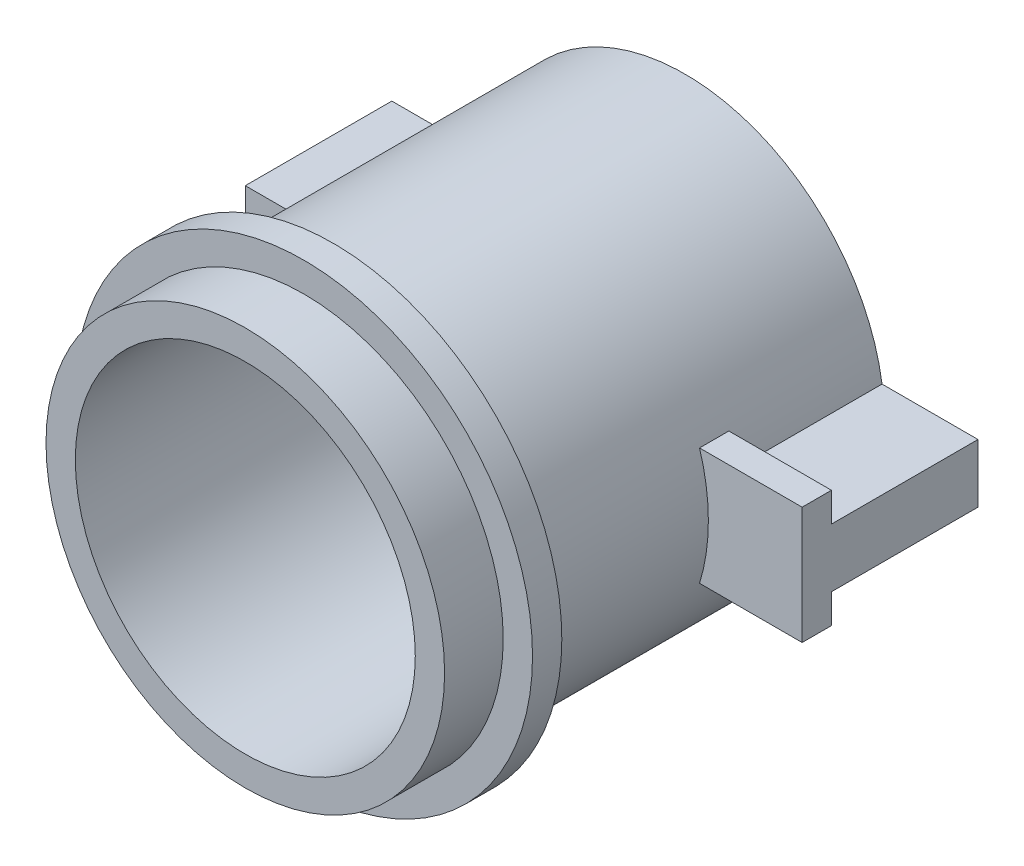
ISO-10303-21;
HEADER;
FILE_DESCRIPTION(('STEP AP214'),'2;1');
FILE_NAME('part.step','',(''),(''),'','','');
FILE_SCHEMA(('AUTOMOTIVE_DESIGN { 1 0 10303 214 1 1 1 1 }'));
ENDSEC;
DATA;
#1=APPLICATION_CONTEXT('core data for automotive mechanical design processes');
#2=APPLICATION_PROTOCOL_DEFINITION('international standard','automotive_design',2000,#1);
#3=PRODUCT_CONTEXT('',#1,'mechanical');
#4=PRODUCT('Part','Part','',(#3));
#5=PRODUCT_RELATED_PRODUCT_CATEGORY('part','',(#4));
#6=PRODUCT_DEFINITION_FORMATION('','',#4);
#7=PRODUCT_DEFINITION_CONTEXT('part definition',#1,'design');
#8=PRODUCT_DEFINITION('design','',#6,#7);
#9=PRODUCT_DEFINITION_SHAPE('','',#8);
#10=(LENGTH_UNIT() NAMED_UNIT(*) SI_UNIT(.MILLI.,.METRE.));
#11=(NAMED_UNIT(*) PLANE_ANGLE_UNIT() SI_UNIT($,.RADIAN.));
#12=(NAMED_UNIT(*) SI_UNIT($,.STERADIAN.) SOLID_ANGLE_UNIT());
#13=UNCERTAINTY_MEASURE_WITH_UNIT(LENGTH_MEASURE(1.E-05),#10,'distance_accuracy_value','');
#14=(GEOMETRIC_REPRESENTATION_CONTEXT(3) GLOBAL_UNCERTAINTY_ASSIGNED_CONTEXT((#13)) GLOBAL_UNIT_ASSIGNED_CONTEXT((#10,
#11,#12)) REPRESENTATION_CONTEXT('',''));
#15=CARTESIAN_POINT('',(0.,0.,0.));
#16=DIRECTION('',(0.,0.,1.));
#17=DIRECTION('',(1.,0.,0.));
#18=AXIS2_PLACEMENT_3D('',#15,#16,#17);
#19=CARTESIAN_POINT('',(0.,0.,15.));
#20=DIRECTION('',(0.,0.,-1.));
#21=DIRECTION('',(-1.,0.,0.));
#22=AXIS2_PLACEMENT_3D('',#19,#20,#21);
#23=CYLINDRICAL_SURFACE('',#22,6.8);
#24=DIRECTION('',(0.,0.,-1.));
#25=VECTOR('',#24,1.);
#26=CARTESIAN_POINT('',(6.49923072370877,2.,15.));
#27=LINE('',#26,#25);
#28=CARTESIAN_POINT('',(6.49923072370877,2.,5.));
#29=VERTEX_POINT('',#28);
#30=CARTESIAN_POINT('',(6.49923072370877,2.,6.));
#31=VERTEX_POINT('',#30);
#32=EDGE_CURVE('E170',#29,#31,#27,.F.);
#33=ORIENTED_EDGE('',*,*,#32,.F.);
#34=CARTESIAN_POINT('',(0.,0.,5.));
#35=DIRECTION('',(0.,0.,-1.));
#36=DIRECTION('',(-1.,0.,0.));
#37=AXIS2_PLACEMENT_3D('',#34,#35,#36);
#38=CIRCLE('',#37,6.8);
#39=CARTESIAN_POINT('',(6.72606868832009,0.999999999999999,5.));
#40=VERTEX_POINT('',#39);
#41=EDGE_CURVE('E166',#29,#40,#38,.T.);
#42=ORIENTED_EDGE('',*,*,#41,.T.);
#43=DIRECTION('',(0.,0.,-1.));
#44=VECTOR('',#43,1.);
#45=CARTESIAN_POINT('',(6.72606868832009,0.999999999999999,5.));
#46=LINE('',#45,#44);
#47=CARTESIAN_POINT('',(6.72606868832009,0.999999999999999,0.));
#48=VERTEX_POINT('',#47);
#49=EDGE_CURVE('E217',#40,#48,#46,.T.);
#50=ORIENTED_EDGE('',*,*,#49,.T.);
#51=CARTESIAN_POINT('',(0.,0.,0.));
#52=DIRECTION('',(0.,0.,1.));
#53=DIRECTION('',(1.,0.,0.));
#54=AXIS2_PLACEMENT_3D('',#51,#52,#53);
#55=CIRCLE('',#54,6.8);
#56=CARTESIAN_POINT('',(-6.72606868832009,0.999999999999999,0.));
#57=VERTEX_POINT('',#56);
#58=EDGE_CURVE('E234',#48,#57,#55,.T.);
#59=ORIENTED_EDGE('',*,*,#58,.T.);
#60=DIRECTION('',(0.,0.,-1.));
#61=VECTOR('',#60,1.);
#62=CARTESIAN_POINT('',(-6.72606868832009,0.999999999999998,5.));
#63=LINE('',#62,#61);
#64=CARTESIAN_POINT('',(-6.72606868832009,0.999999999999998,5.));
#65=VERTEX_POINT('',#64);
#66=EDGE_CURVE('E53',#65,#57,#63,.T.);
#67=ORIENTED_EDGE('',*,*,#66,.F.);
#68=CARTESIAN_POINT('',(0.,0.,5.));
#69=DIRECTION('',(0.,0.,1.));
#70=DIRECTION('',(-1.,0.,0.));
#71=AXIS2_PLACEMENT_3D('',#68,#69,#70);
#72=CIRCLE('',#71,6.8);
#73=CARTESIAN_POINT('',(-6.7260686883201,-1.,5.));
#74=VERTEX_POINT('',#73);
#75=EDGE_CURVE('E57',#65,#74,#72,.T.);
#76=ORIENTED_EDGE('',*,*,#75,.T.);
#77=DIRECTION('',(0.,0.,-1.));
#78=VECTOR('',#77,1.);
#79=CARTESIAN_POINT('',(-6.72606868832009,-1.,5.));
#80=LINE('',#79,#78);
#81=CARTESIAN_POINT('',(-6.72606868832009,-1.,0.));
#82=VERTEX_POINT('',#81);
#83=EDGE_CURVE('E195',#74,#82,#80,.T.);
#84=ORIENTED_EDGE('',*,*,#83,.T.);
#85=CARTESIAN_POINT('',(6.72606868832009,-1.,0.));
#86=VERTEX_POINT('',#85);
#87=EDGE_CURVE('E229',#82,#86,#55,.T.);
#88=ORIENTED_EDGE('',*,*,#87,.T.);
#89=DIRECTION('',(0.,0.,-1.));
#90=VECTOR('',#89,1.);
#91=CARTESIAN_POINT('',(6.72606868832009,-1.,5.));
#92=LINE('',#91,#90);
#93=CARTESIAN_POINT('',(6.72606868832009,-1.,5.));
#94=VERTEX_POINT('',#93);
#95=EDGE_CURVE('E220',#94,#86,#92,.T.);
#96=ORIENTED_EDGE('',*,*,#95,.F.);
#97=CARTESIAN_POINT('',(6.49923072370877,-2.,5.));
#98=VERTEX_POINT('',#97);
#99=EDGE_CURVE('E145',#94,#98,#38,.T.);
#100=ORIENTED_EDGE('',*,*,#99,.T.);
#101=DIRECTION('',(0.,0.,-1.));
#102=VECTOR('',#101,1.);
#103=CARTESIAN_POINT('',(6.49923072370877,-2.,15.));
#104=LINE('',#103,#102);
#105=CARTESIAN_POINT('',(6.49923072370877,-2.,6.));
#106=VERTEX_POINT('',#105);
#107=EDGE_CURVE('E168',#106,#98,#104,.T.);
#108=ORIENTED_EDGE('',*,*,#107,.F.);
#109=CARTESIAN_POINT('',(0.,0.,6.));
#110=DIRECTION('',(0.,0.,-1.));
#111=DIRECTION('',(-1.,0.,0.));
#112=AXIS2_PLACEMENT_3D('',#109,#110,#111);
#113=CIRCLE('',#112,6.8);
#114=EDGE_CURVE('E133',#31,#106,#113,.T.);
#115=ORIENTED_EDGE('',*,*,#114,.F.);
#116=EDGE_LOOP('',(#33,#42,#50,#59,#67,#76,#84,#88,#96,#100,#108,#115));
#117=FACE_BOUND('',#116,.T.);
#118=CARTESIAN_POINT('',(0.,0.,12.));
#119=DIRECTION('',(0.,0.,1.));
#120=DIRECTION('',(1.,0.,0.));
#121=AXIS2_PLACEMENT_3D('',#118,#119,#120);
#122=CIRCLE('',#121,6.8);
#123=CARTESIAN_POINT('',(6.8,0.,12.));
#124=VERTEX_POINT('',#123);
#125=EDGE_CURVE('E11',#124,#124,#122,.T.);
#126=ORIENTED_EDGE('',*,*,#125,.F.);
#127=EDGE_LOOP('',(#126));
#128=FACE_BOUND('',#127,.T.);
#129=ADVANCED_FACE('F37',(#117,#128),#23,.T.);
#130=CARTESIAN_POINT('',(0.,0.,13.));
#131=DIRECTION('',(0.,0.,1.));
#132=DIRECTION('',(1.,0.,0.));
#133=AXIS2_PLACEMENT_3D('',#130,#131,#132);
#134=CIRCLE('',#133,6.8);
#135=CARTESIAN_POINT('',(6.8,0.,13.));
#136=VERTEX_POINT('',#135);
#137=EDGE_CURVE('E330',#136,#136,#134,.T.);
#138=ORIENTED_EDGE('',*,*,#137,.T.);
#139=EDGE_LOOP('',(#138));
#140=FACE_BOUND('',#139,.T.);
#141=CARTESIAN_POINT('',(0.,0.,15.));
#142=DIRECTION('',(0.,0.,1.));
#143=DIRECTION('',(1.,0.,0.));
#144=AXIS2_PLACEMENT_3D('',#141,#142,#143);
#145=CIRCLE('',#144,6.8);
#146=CARTESIAN_POINT('',(6.8,0.,15.));
#147=VERTEX_POINT('',#146);
#148=EDGE_CURVE('E230',#147,#147,#145,.T.);
#149=ORIENTED_EDGE('',*,*,#148,.F.);
#150=EDGE_LOOP('',(#149));
#151=FACE_BOUND('',#150,.T.);
#152=ADVANCED_FACE('F255',(#140,#151),#23,.T.);
#153=CARTESIAN_POINT('',(0.,0.,15.));
#154=DIRECTION('',(0.,0.,1.));
#155=DIRECTION('',(1.,0.,0.));
#156=AXIS2_PLACEMENT_3D('',#153,#154,#155);
#157=PLANE('',#156);
#158=CARTESIAN_POINT('',(0.,0.,15.));
#159=DIRECTION('',(0.,0.,1.));
#160=DIRECTION('',(1.,0.,0.));
#161=AXIS2_PLACEMENT_3D('',#158,#159,#160);
#162=CIRCLE('',#161,5.8);
#163=CARTESIAN_POINT('',(5.8,0.,15.));
#164=VERTEX_POINT('',#163);
#165=EDGE_CURVE('E226',#164,#164,#162,.T.);
#166=ORIENTED_EDGE('',*,*,#165,.F.);
#167=EDGE_LOOP('',(#166));
#168=FACE_BOUND('',#167,.T.);
#169=ORIENTED_EDGE('',*,*,#148,.T.);
#170=EDGE_LOOP('',(#169));
#171=FACE_BOUND('',#170,.T.);
#172=ADVANCED_FACE('F259',(#168,#171),#157,.T.);
#173=CARTESIAN_POINT('',(0.,0.,0.));
#174=DIRECTION('',(0.,0.,1.));
#175=DIRECTION('',(1.,0.,0.));
#176=AXIS2_PLACEMENT_3D('',#173,#174,#175);
#177=PLANE('',#176);
#178=CARTESIAN_POINT('',(0.,0.,0.));
#179=DIRECTION('',(0.,0.,-1.));
#180=DIRECTION('',(-1.,0.,0.));
#181=AXIS2_PLACEMENT_3D('',#178,#179,#180);
#182=CIRCLE('',#181,3.55);
#183=CARTESIAN_POINT('',(-3.55,0.,0.));
#184=VERTEX_POINT('',#183);
#185=EDGE_CURVE('E216',#184,#184,#182,.T.);
#186=ORIENTED_EDGE('',*,*,#185,.F.);
#187=EDGE_LOOP('',(#186));
#188=FACE_BOUND('',#187,.T.);
#189=ORIENTED_EDGE('',*,*,#58,.F.);
#190=DIRECTION('',(1.,0.,0.));
#191=VECTOR('',#190,1.);
#192=CARTESIAN_POINT('',(6.72606868832009,0.999999999999999,0.));
#193=LINE('',#192,#191);
#194=CARTESIAN_POINT('',(10.,0.999999999999999,0.));
#195=VERTEX_POINT('',#194);
#196=EDGE_CURVE('E203',#48,#195,#193,.T.);
#197=ORIENTED_EDGE('',*,*,#196,.T.);
#198=DIRECTION('',(0.,-1.,0.));
#199=VECTOR('',#198,1.);
#200=CARTESIAN_POINT('',(10.,-1.,0.));
#201=LINE('',#200,#199);
#202=CARTESIAN_POINT('',(10.,-1.,0.));
#203=VERTEX_POINT('',#202);
#204=EDGE_CURVE('E194',#195,#203,#201,.T.);
#205=ORIENTED_EDGE('',*,*,#204,.T.);
#206=DIRECTION('',(-1.,0.,0.));
#207=VECTOR('',#206,1.);
#208=CARTESIAN_POINT('',(6.72606868832009,-1.,0.));
#209=LINE('',#208,#207);
#210=EDGE_CURVE('E209',#203,#86,#209,.T.);
#211=ORIENTED_EDGE('',*,*,#210,.T.);
#212=ORIENTED_EDGE('',*,*,#87,.F.);
#213=DIRECTION('',(-1.,0.,0.));
#214=VECTOR('',#213,1.);
#215=CARTESIAN_POINT('',(-10.,-0.999999999999999,0.));
#216=LINE('',#215,#214);
#217=CARTESIAN_POINT('',(-10.,-0.999999999999999,0.));
#218=VERTEX_POINT('',#217);
#219=EDGE_CURVE('E177',#82,#218,#216,.T.);
#220=ORIENTED_EDGE('',*,*,#219,.T.);
#221=DIRECTION('',(0.,1.,0.));
#222=VECTOR('',#221,1.);
#223=CARTESIAN_POINT('',(-10.,-0.999999999999999,0.));
#224=LINE('',#223,#222);
#225=CARTESIAN_POINT('',(-10.,1.,0.));
#226=VERTEX_POINT('',#225);
#227=EDGE_CURVE('E172',#218,#226,#224,.T.);
#228=ORIENTED_EDGE('',*,*,#227,.T.);
#229=DIRECTION('',(1.,0.,0.));
#230=VECTOR('',#229,1.);
#231=CARTESIAN_POINT('',(-10.,1.,0.));
#232=LINE('',#231,#230);
#233=EDGE_CURVE('E187',#226,#57,#232,.T.);
#234=ORIENTED_EDGE('',*,*,#233,.T.);
#235=EDGE_LOOP('',(#189,#197,#205,#211,#212,#220,#228,#234));
#236=FACE_BOUND('',#235,.T.);
#237=ADVANCED_FACE('F264',(#188,#236),#177,.F.);
#238=CARTESIAN_POINT('',(0.,0.,15.));
#239=DIRECTION('',(0.,0.,-1.));
#240=DIRECTION('',(-1.,0.,0.));
#241=AXIS2_PLACEMENT_3D('',#238,#239,#240);
#242=CYLINDRICAL_SURFACE('',#241,5.8);
#243=CARTESIAN_POINT('',(0.,0.,4.00000000000002));
#244=DIRECTION('',(0.,0.,1.));
#245=DIRECTION('',(1.,0.,0.));
#246=AXIS2_PLACEMENT_3D('',#243,#244,#245);
#247=CIRCLE('',#246,5.8);
#248=CARTESIAN_POINT('',(5.8,0.,4.00000000000002));
#249=VERTEX_POINT('',#248);
#250=EDGE_CURVE('E233',#249,#249,#247,.F.);
#251=ORIENTED_EDGE('',*,*,#250,.T.);
#252=EDGE_LOOP('',(#251));
#253=FACE_BOUND('',#252,.T.);
#254=ORIENTED_EDGE('',*,*,#165,.T.);
#255=EDGE_LOOP('',(#254));
#256=FACE_BOUND('',#255,.T.);
#257=ADVANCED_FACE('F251',(#253,#256),#242,.F.);
#258=CARTESIAN_POINT('',(0.,0.,15.));
#259=DIRECTION('',(0.,0.,-1.));
#260=DIRECTION('',(-1.,0.,0.));
#261=AXIS2_PLACEMENT_3D('',#258,#259,#260);
#262=CYLINDRICAL_SURFACE('',#261,3.55);
#263=CARTESIAN_POINT('',(0.,0.,1.75000000000005));
#264=DIRECTION('',(0.,0.,1.));
#265=DIRECTION('',(1.,0.,0.));
#266=AXIS2_PLACEMENT_3D('',#263,#264,#265);
#267=CIRCLE('',#266,3.55);
#268=CARTESIAN_POINT('',(3.55,0.,1.75000000000005));
#269=VERTEX_POINT('',#268);
#270=EDGE_CURVE('E46',#269,#269,#267,.T.);
#271=ORIENTED_EDGE('',*,*,#270,.T.);
#272=EDGE_LOOP('',(#271));
#273=FACE_BOUND('',#272,.T.);
#274=ORIENTED_EDGE('',*,*,#185,.T.);
#275=EDGE_LOOP('',(#274));
#276=FACE_BOUND('',#275,.T.);
#277=ADVANCED_FACE('F240',(#273,#276),#262,.F.);
#278=CARTESIAN_POINT('',(0.,0.,1.));
#279=DIRECTION('',(0.,0.,1.));
#280=DIRECTION('',(1.,0.,0.));
#281=AXIS2_PLACEMENT_3D('',#278,#279,#280);
#282=CONICAL_SURFACE('',#281,2.79999999999995,0.785398163397454);
#283=ORIENTED_EDGE('',*,*,#250,.F.);
#284=EDGE_LOOP('',(#283));
#285=FACE_BOUND('',#284,.T.);
#286=ORIENTED_EDGE('',*,*,#270,.F.);
#287=EDGE_LOOP('',(#286));
#288=FACE_BOUND('',#287,.T.);
#289=ADVANCED_FACE('F40',(#285,#288),#282,.F.);
#290=CARTESIAN_POINT('',(10.,-1.,5.));
#291=DIRECTION('',(1.,0.,0.));
#292=DIRECTION('',(0.,0.,-1.));
#293=AXIS2_PLACEMENT_3D('',#290,#291,#292);
#294=PLANE('',#293);
#295=ORIENTED_EDGE('',*,*,#204,.F.);
#296=DIRECTION('',(0.,0.,-1.));
#297=VECTOR('',#296,1.);
#298=CARTESIAN_POINT('',(10.,0.999999999999999,5.));
#299=LINE('',#298,#297);
#300=CARTESIAN_POINT('',(10.,0.999999999999999,5.));
#301=VERTEX_POINT('',#300);
#302=EDGE_CURVE('E214',#301,#195,#299,.T.);
#303=ORIENTED_EDGE('',*,*,#302,.F.);
#304=DIRECTION('',(0.,1.,0.));
#305=VECTOR('',#304,1.);
#306=CARTESIAN_POINT('',(10.,2.,5.));
#307=LINE('',#306,#305);
#308=CARTESIAN_POINT('',(10.,2.,5.));
#309=VERTEX_POINT('',#308);
#310=EDGE_CURVE('E161',#301,#309,#307,.T.);
#311=ORIENTED_EDGE('',*,*,#310,.T.);
#312=DIRECTION('',(0.,0.,-1.));
#313=VECTOR('',#312,1.);
#314=CARTESIAN_POINT('',(10.,2.,6.));
#315=LINE('',#314,#313);
#316=CARTESIAN_POINT('',(10.,2.,6.));
#317=VERTEX_POINT('',#316);
#318=EDGE_CURVE('E146',#317,#309,#315,.T.);
#319=ORIENTED_EDGE('',*,*,#318,.F.);
#320=DIRECTION('',(0.,1.,0.));
#321=VECTOR('',#320,1.);
#322=CARTESIAN_POINT('',(10.,2.,6.));
#323=LINE('',#322,#321);
#324=CARTESIAN_POINT('',(10.,-2.,6.));
#325=VERTEX_POINT('',#324);
#326=EDGE_CURVE('E130',#325,#317,#323,.T.);
#327=ORIENTED_EDGE('',*,*,#326,.F.);
#328=DIRECTION('',(0.,0.,-1.));
#329=VECTOR('',#328,1.);
#330=CARTESIAN_POINT('',(10.,-2.,6.));
#331=LINE('',#330,#329);
#332=CARTESIAN_POINT('',(10.,-2.,5.));
#333=VERTEX_POINT('',#332);
#334=EDGE_CURVE('E139',#325,#333,#331,.T.);
#335=ORIENTED_EDGE('',*,*,#334,.T.);
#336=CARTESIAN_POINT('',(10.,-1.,5.));
#337=VERTEX_POINT('',#336);
#338=EDGE_CURVE('E162',#333,#337,#307,.T.);
#339=ORIENTED_EDGE('',*,*,#338,.T.);
#340=DIRECTION('',(0.,0.,-1.));
#341=VECTOR('',#340,1.);
#342=CARTESIAN_POINT('',(10.,-1.,5.));
#343=LINE('',#342,#341);
#344=EDGE_CURVE('E206',#337,#203,#343,.T.);
#345=ORIENTED_EDGE('',*,*,#344,.T.);
#346=EDGE_LOOP('',(#295,#303,#311,#319,#327,#335,#339,#345));
#347=FACE_BOUND('',#346,.T.);
#348=ADVANCED_FACE('F149',(#347),#294,.T.);
#349=CARTESIAN_POINT('',(6.72606868832009,0.999999999999999,5.));
#350=DIRECTION('',(0.,1.,0.));
#351=DIRECTION('',(-1.,0.,0.));
#352=AXIS2_PLACEMENT_3D('',#349,#350,#351);
#353=PLANE('',#352);
#354=ORIENTED_EDGE('',*,*,#196,.F.);
#355=ORIENTED_EDGE('',*,*,#49,.F.);
#356=DIRECTION('',(1.,0.,0.));
#357=VECTOR('',#356,1.);
#358=CARTESIAN_POINT('',(6.72606868832009,0.999999999999999,5.));
#359=LINE('',#358,#357);
#360=EDGE_CURVE('E202',#40,#301,#359,.T.);
#361=ORIENTED_EDGE('',*,*,#360,.T.);
#362=ORIENTED_EDGE('',*,*,#302,.T.);
#363=EDGE_LOOP('',(#354,#355,#361,#362));
#364=FACE_BOUND('',#363,.T.);
#365=ADVANCED_FACE('F249',(#364),#353,.T.);
#366=CARTESIAN_POINT('',(6.72606868832009,-1.,5.));
#367=DIRECTION('',(0.,-1.,0.));
#368=DIRECTION('',(1.,0.,0.));
#369=AXIS2_PLACEMENT_3D('',#366,#367,#368);
#370=PLANE('',#369);
#371=ORIENTED_EDGE('',*,*,#210,.F.);
#372=ORIENTED_EDGE('',*,*,#344,.F.);
#373=DIRECTION('',(-1.,0.,0.));
#374=VECTOR('',#373,1.);
#375=CARTESIAN_POINT('',(6.72606868832009,-1.,5.));
#376=LINE('',#375,#374);
#377=EDGE_CURVE('E199',#337,#94,#376,.T.);
#378=ORIENTED_EDGE('',*,*,#377,.T.);
#379=ORIENTED_EDGE('',*,*,#95,.T.);
#380=EDGE_LOOP('',(#371,#372,#378,#379));
#381=FACE_BOUND('',#380,.T.);
#382=ADVANCED_FACE('F274',(#381),#370,.T.);
#383=CARTESIAN_POINT('',(-10.,-0.999999999999999,5.));
#384=DIRECTION('',(-1.,0.,0.));
#385=DIRECTION('',(0.,0.,1.));
#386=AXIS2_PLACEMENT_3D('',#383,#384,#385);
#387=PLANE('',#386);
#388=ORIENTED_EDGE('',*,*,#227,.F.);
#389=DIRECTION('',(0.,0.,-1.));
#390=VECTOR('',#389,1.);
#391=CARTESIAN_POINT('',(-10.,-0.999999999999999,5.));
#392=LINE('',#391,#390);
#393=CARTESIAN_POINT('',(-10.,-0.999999999999999,5.));
#394=VERTEX_POINT('',#393);
#395=EDGE_CURVE('E192',#394,#218,#392,.T.);
#396=ORIENTED_EDGE('',*,*,#395,.F.);
#397=DIRECTION('',(0.,1.,0.));
#398=VECTOR('',#397,1.);
#399=CARTESIAN_POINT('',(-10.,-0.999999999999999,5.));
#400=LINE('',#399,#398);
#401=CARTESIAN_POINT('',(-10.,1.,5.));
#402=VERTEX_POINT('',#401);
#403=EDGE_CURVE('E173',#394,#402,#400,.T.);
#404=ORIENTED_EDGE('',*,*,#403,.T.);
#405=DIRECTION('',(0.,0.,-1.));
#406=VECTOR('',#405,1.);
#407=CARTESIAN_POINT('',(-10.,1.,5.));
#408=LINE('',#407,#406);
#409=EDGE_CURVE('E184',#402,#226,#408,.T.);
#410=ORIENTED_EDGE('',*,*,#409,.T.);
#411=EDGE_LOOP('',(#388,#396,#404,#410));
#412=FACE_BOUND('',#411,.T.);
#413=ADVANCED_FACE('F277',(#412),#387,.T.);
#414=CARTESIAN_POINT('',(-10.,-0.999999999999999,5.));
#415=DIRECTION('',(0.,-1.,0.));
#416=DIRECTION('',(1.,0.,0.));
#417=AXIS2_PLACEMENT_3D('',#414,#415,#416);
#418=PLANE('',#417);
#419=ORIENTED_EDGE('',*,*,#219,.F.);
#420=ORIENTED_EDGE('',*,*,#83,.F.);
#421=DIRECTION('',(-1.,0.,0.));
#422=VECTOR('',#421,1.);
#423=CARTESIAN_POINT('',(-10.,-0.999999999999999,5.));
#424=LINE('',#423,#422);
#425=EDGE_CURVE('E181',#74,#394,#424,.T.);
#426=ORIENTED_EDGE('',*,*,#425,.T.);
#427=ORIENTED_EDGE('',*,*,#395,.T.);
#428=EDGE_LOOP('',(#419,#420,#426,#427));
#429=FACE_BOUND('',#428,.T.);
#430=ADVANCED_FACE('F284',(#429),#418,.T.);
#431=CARTESIAN_POINT('',(-10.,1.,5.));
#432=DIRECTION('',(0.,1.,0.));
#433=DIRECTION('',(-1.,0.,0.));
#434=AXIS2_PLACEMENT_3D('',#431,#432,#433);
#435=PLANE('',#434);
#436=ORIENTED_EDGE('',*,*,#233,.F.);
#437=ORIENTED_EDGE('',*,*,#409,.F.);
#438=DIRECTION('',(1.,0.,0.));
#439=VECTOR('',#438,1.);
#440=CARTESIAN_POINT('',(-10.,1.,5.));
#441=LINE('',#440,#439);
#442=EDGE_CURVE('E176',#402,#65,#441,.T.);
#443=ORIENTED_EDGE('',*,*,#442,.T.);
#444=ORIENTED_EDGE('',*,*,#66,.T.);
#445=EDGE_LOOP('',(#436,#437,#443,#444));
#446=FACE_BOUND('',#445,.T.);
#447=ADVANCED_FACE('F286',(#446),#435,.T.);
#448=CARTESIAN_POINT('',(0.,0.,5.));
#449=DIRECTION('',(0.,0.,-1.));
#450=DIRECTION('',(-1.,0.,0.));
#451=AXIS2_PLACEMENT_3D('',#448,#449,#450);
#452=PLANE('',#451);
#453=ORIENTED_EDGE('',*,*,#403,.F.);
#454=ORIENTED_EDGE('',*,*,#425,.F.);
#455=ORIENTED_EDGE('',*,*,#75,.F.);
#456=ORIENTED_EDGE('',*,*,#442,.F.);
#457=EDGE_LOOP('',(#453,#454,#455,#456));
#458=FACE_BOUND('',#457,.T.);
#459=ADVANCED_FACE('F289',(#458),#452,.F.);
#460=CARTESIAN_POINT('',(6.49923072370877,2.,6.));
#461=DIRECTION('',(0.,-1.,0.));
#462=DIRECTION('',(1.,0.,0.));
#463=AXIS2_PLACEMENT_3D('',#460,#461,#462);
#464=PLANE('',#463);
#465=DIRECTION('',(-1.,0.,0.));
#466=VECTOR('',#465,1.);
#467=CARTESIAN_POINT('',(6.49923072370877,2.,5.));
#468=LINE('',#467,#466);
#469=EDGE_CURVE('E156',#309,#29,#468,.T.);
#470=ORIENTED_EDGE('',*,*,#469,.T.);
#471=ORIENTED_EDGE('',*,*,#32,.T.);
#472=DIRECTION('',(-1.,0.,0.));
#473=VECTOR('',#472,1.);
#474=CARTESIAN_POINT('',(10.,2.,6.));
#475=LINE('',#474,#473);
#476=EDGE_CURVE('E136',#317,#31,#475,.T.);
#477=ORIENTED_EDGE('',*,*,#476,.F.);
#478=ORIENTED_EDGE('',*,*,#318,.T.);
#479=EDGE_LOOP('',(#470,#471,#477,#478));
#480=FACE_BOUND('',#479,.T.);
#481=ADVANCED_FACE('F296',(#480),#464,.F.);
#482=CARTESIAN_POINT('',(6.49923072370877,-2.,6.));
#483=DIRECTION('',(0.,1.,0.));
#484=DIRECTION('',(-1.,0.,0.));
#485=AXIS2_PLACEMENT_3D('',#482,#483,#484);
#486=PLANE('',#485);
#487=DIRECTION('',(1.,0.,0.));
#488=VECTOR('',#487,1.);
#489=CARTESIAN_POINT('',(6.49923072370877,-2.,6.));
#490=LINE('',#489,#488);
#491=EDGE_CURVE('E125',#106,#325,#490,.T.);
#492=ORIENTED_EDGE('',*,*,#491,.F.);
#493=ORIENTED_EDGE('',*,*,#107,.T.);
#494=DIRECTION('',(1.,0.,0.));
#495=VECTOR('',#494,1.);
#496=CARTESIAN_POINT('',(6.49923072370877,-2.,5.));
#497=LINE('',#496,#495);
#498=EDGE_CURVE('E142',#98,#333,#497,.T.);
#499=ORIENTED_EDGE('',*,*,#498,.T.);
#500=ORIENTED_EDGE('',*,*,#334,.F.);
#501=EDGE_LOOP('',(#492,#493,#499,#500));
#502=FACE_BOUND('',#501,.T.);
#503=ADVANCED_FACE('F140',(#502),#486,.F.);
#504=CARTESIAN_POINT('',(0.,0.,6.));
#505=DIRECTION('',(0.,0.,-1.));
#506=DIRECTION('',(-1.,0.,0.));
#507=AXIS2_PLACEMENT_3D('',#504,#505,#506);
#508=PLANE('',#507);
#509=ORIENTED_EDGE('',*,*,#476,.T.);
#510=ORIENTED_EDGE('',*,*,#114,.T.);
#511=ORIENTED_EDGE('',*,*,#491,.T.);
#512=ORIENTED_EDGE('',*,*,#326,.T.);
#513=EDGE_LOOP('',(#509,#510,#511,#512));
#514=FACE_BOUND('',#513,.T.);
#515=ADVANCED_FACE('F128',(#514),#508,.F.);
#516=CARTESIAN_POINT('',(0.,0.,5.));
#517=DIRECTION('',(0.,0.,-1.));
#518=DIRECTION('',(-1.,0.,0.));
#519=AXIS2_PLACEMENT_3D('',#516,#517,#518);
#520=PLANE('',#519);
#521=ORIENTED_EDGE('',*,*,#41,.F.);
#522=ORIENTED_EDGE('',*,*,#469,.F.);
#523=ORIENTED_EDGE('',*,*,#310,.F.);
#524=ORIENTED_EDGE('',*,*,#360,.F.);
#525=EDGE_LOOP('',(#521,#522,#523,#524));
#526=FACE_BOUND('',#525,.T.);
#527=ADVANCED_FACE('F303',(#526),#520,.T.);
#528=ORIENTED_EDGE('',*,*,#99,.F.);
#529=ORIENTED_EDGE('',*,*,#377,.F.);
#530=ORIENTED_EDGE('',*,*,#338,.F.);
#531=ORIENTED_EDGE('',*,*,#498,.F.);
#532=EDGE_LOOP('',(#528,#529,#530,#531));
#533=FACE_BOUND('',#532,.T.);
#534=ADVANCED_FACE('F306',(#533),#520,.T.);
#535=CARTESIAN_POINT('',(0.,0.,12.));
#536=DIRECTION('',(0.,0.,1.));
#537=DIRECTION('',(1.,0.,0.));
#538=AXIS2_PLACEMENT_3D('',#535,#536,#537);
#539=CYLINDRICAL_SURFACE('',#538,7.8);
#540=CARTESIAN_POINT('',(0.,0.,12.));
#541=DIRECTION('',(0.,0.,1.));
#542=DIRECTION('',(1.,0.,0.));
#543=AXIS2_PLACEMENT_3D('',#540,#541,#542);
#544=CIRCLE('',#543,7.8);
#545=CARTESIAN_POINT('',(7.8,0.,12.));
#546=VERTEX_POINT('',#545);
#547=EDGE_CURVE('E159',#546,#546,#544,.T.);
#548=ORIENTED_EDGE('',*,*,#547,.T.);
#549=EDGE_LOOP('',(#548));
#550=FACE_BOUND('',#549,.T.);
#551=CARTESIAN_POINT('',(0.,0.,13.));
#552=DIRECTION('',(0.,0.,1.));
#553=DIRECTION('',(1.,0.,0.));
#554=AXIS2_PLACEMENT_3D('',#551,#552,#553);
#555=CIRCLE('',#554,7.8);
#556=CARTESIAN_POINT('',(7.8,0.,13.));
#557=VERTEX_POINT('',#556);
#558=EDGE_CURVE('E327',#557,#557,#555,.T.);
#559=ORIENTED_EDGE('',*,*,#558,.F.);
#560=EDGE_LOOP('',(#559));
#561=FACE_BOUND('',#560,.T.);
#562=ADVANCED_FACE('F310',(#550,#561),#539,.T.);
#563=CARTESIAN_POINT('',(0.,0.,12.));
#564=DIRECTION('',(0.,0.,1.));
#565=DIRECTION('',(1.,0.,0.));
#566=AXIS2_PLACEMENT_3D('',#563,#564,#565);
#567=PLANE('',#566);
#568=ORIENTED_EDGE('',*,*,#125,.T.);
#569=EDGE_LOOP('',(#568));
#570=FACE_BOUND('',#569,.T.);
#571=ORIENTED_EDGE('',*,*,#547,.F.);
#572=EDGE_LOOP('',(#571));
#573=FACE_BOUND('',#572,.T.);
#574=ADVANCED_FACE('F313',(#570,#573),#567,.F.);
#575=CARTESIAN_POINT('',(0.,0.,13.));
#576=DIRECTION('',(0.,0.,1.));
#577=DIRECTION('',(1.,0.,0.));
#578=AXIS2_PLACEMENT_3D('',#575,#576,#577);
#579=PLANE('',#578);
#580=ORIENTED_EDGE('',*,*,#137,.F.);
#581=EDGE_LOOP('',(#580));
#582=FACE_BOUND('',#581,.T.);
#583=ORIENTED_EDGE('',*,*,#558,.T.);
#584=EDGE_LOOP('',(#583));
#585=FACE_BOUND('',#584,.T.);
#586=ADVANCED_FACE('F315',(#582,#585),#579,.T.);
#587=CLOSED_SHELL('',(#129,#152,#172,#237,#257,#277,#289,#348,#365,#382,#413,#430,#447,#459,
#481,#503,#515,#527,#534,#562,#574,#586));
#588=MANIFOLD_SOLID_BREP('B2',#587);
#589=ADVANCED_BREP_SHAPE_REPRESENTATION('',(#18,#588),#14);
#590=SHAPE_DEFINITION_REPRESENTATION(#9,#589);
ENDSEC;
END-ISO-10303-21;
